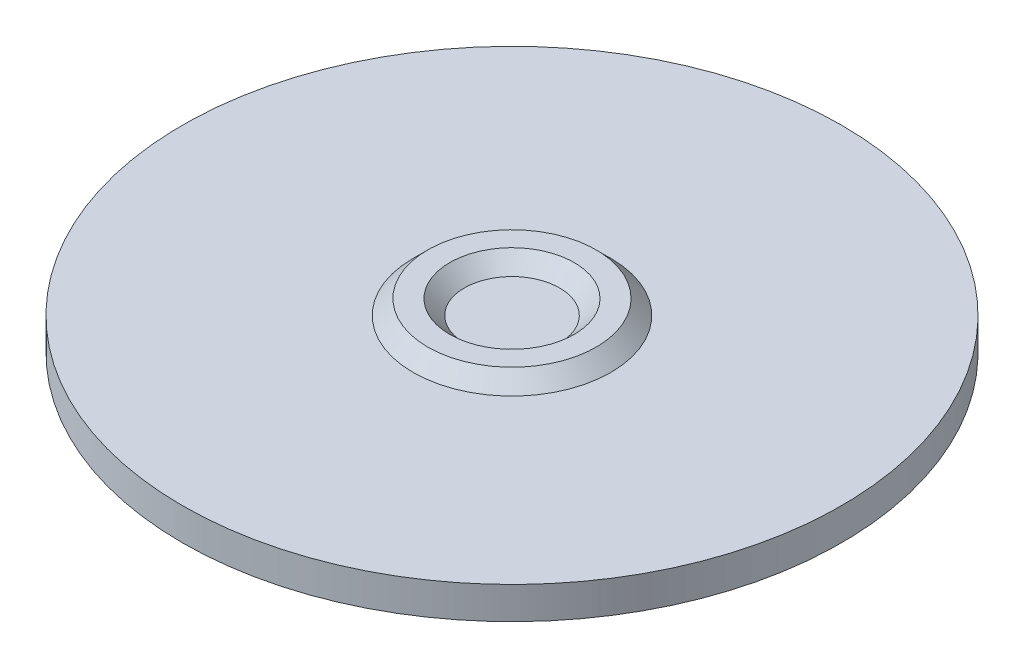
ISO-10303-21;
HEADER;
FILE_DESCRIPTION(('STEP AP214'),'2;1');
FILE_NAME('part.step','',(''),(''),'','','');
FILE_SCHEMA(('AUTOMOTIVE_DESIGN { 1 0 10303 214 1 1 1 1 }'));
ENDSEC;
DATA;
#1=APPLICATION_CONTEXT('core data for automotive mechanical design processes');
#2=APPLICATION_PROTOCOL_DEFINITION('international standard','automotive_design',2000,#1);
#3=PRODUCT_CONTEXT('',#1,'mechanical');
#4=PRODUCT('Part','Part','',(#3));
#5=PRODUCT_RELATED_PRODUCT_CATEGORY('part','',(#4));
#6=PRODUCT_DEFINITION_FORMATION('','',#4);
#7=PRODUCT_DEFINITION_CONTEXT('part definition',#1,'design');
#8=PRODUCT_DEFINITION('design','',#6,#7);
#9=PRODUCT_DEFINITION_SHAPE('','',#8);
#10=(LENGTH_UNIT() NAMED_UNIT(*) SI_UNIT(.MILLI.,.METRE.));
#11=(NAMED_UNIT(*) PLANE_ANGLE_UNIT() SI_UNIT($,.RADIAN.));
#12=(NAMED_UNIT(*) SI_UNIT($,.STERADIAN.) SOLID_ANGLE_UNIT());
#13=UNCERTAINTY_MEASURE_WITH_UNIT(LENGTH_MEASURE(1.E-05),#10,'distance_accuracy_value','');
#14=(GEOMETRIC_REPRESENTATION_CONTEXT(3) GLOBAL_UNCERTAINTY_ASSIGNED_CONTEXT((#13)) GLOBAL_UNIT_ASSIGNED_CONTEXT((#10,
#11,#12)) REPRESENTATION_CONTEXT('',''));
#15=CARTESIAN_POINT('',(0.,0.,0.));
#16=DIRECTION('',(0.,0.,1.));
#17=DIRECTION('',(1.,0.,0.));
#18=AXIS2_PLACEMENT_3D('',#15,#16,#17);
#19=CARTESIAN_POINT('',(0.,2.2,0.));
#20=DIRECTION('',(0.,-1.,0.));
#21=DIRECTION('',(0.,0.,1.));
#22=AXIS2_PLACEMENT_3D('',#19,#20,#21);
#23=CONICAL_SURFACE('',#22,6.75,0.78539816339745);
#24=CARTESIAN_POINT('',(0.,3.2,0.));
#25=DIRECTION('',(0.,1.,0.));
#26=DIRECTION('',(0.,0.,1.));
#27=AXIS2_PLACEMENT_3D('',#24,#25,#26);
#28=CIRCLE('',#27,5.75);
#29=CARTESIAN_POINT('',(0.,3.2,5.75));
#30=VERTEX_POINT('',#29);
#31=EDGE_CURVE('E11',#30,#30,#28,.T.);
#32=ORIENTED_EDGE('',*,*,#31,.F.);
#33=EDGE_LOOP('',(#32));
#34=FACE_BOUND('',#33,.T.);
#35=CARTESIAN_POINT('',(0.,2.2,0.));
#36=DIRECTION('',(0.,1.,0.));
#37=DIRECTION('',(0.,0.,1.));
#38=AXIS2_PLACEMENT_3D('',#35,#36,#37);
#39=CIRCLE('',#38,6.75);
#40=CARTESIAN_POINT('',(0.,2.2,6.75));
#41=VERTEX_POINT('',#40);
#42=EDGE_CURVE('E52',#41,#41,#39,.T.);
#43=ORIENTED_EDGE('',*,*,#42,.T.);
#44=EDGE_LOOP('',(#43));
#45=FACE_BOUND('',#44,.T.);
#46=ADVANCED_FACE('F46',(#34,#45),#23,.T.);
#47=CARTESIAN_POINT('',(0.,3.2,0.));
#48=DIRECTION('',(0.,1.,0.));
#49=DIRECTION('',(0.,0.,1.));
#50=AXIS2_PLACEMENT_3D('',#47,#48,#49);
#51=PLANE('',#50);
#52=CARTESIAN_POINT('',(0.,3.2,0.));
#53=DIRECTION('',(0.,1.,0.));
#54=DIRECTION('',(0.,0.,1.));
#55=AXIS2_PLACEMENT_3D('',#52,#53,#54);
#56=CIRCLE('',#55,4.25);
#57=CARTESIAN_POINT('',(0.,3.2,4.25));
#58=VERTEX_POINT('',#57);
#59=EDGE_CURVE('E60',#58,#58,#56,.T.);
#60=ORIENTED_EDGE('',*,*,#59,.F.);
#61=EDGE_LOOP('',(#60));
#62=FACE_BOUND('',#61,.T.);
#63=ORIENTED_EDGE('',*,*,#31,.T.);
#64=EDGE_LOOP('',(#63));
#65=FACE_BOUND('',#64,.T.);
#66=ADVANCED_FACE('F68',(#62,#65),#51,.T.);
#67=CARTESIAN_POINT('',(0.,2.2,0.));
#68=DIRECTION('',(0.,1.,0.));
#69=DIRECTION('',(0.,0.,1.));
#70=AXIS2_PLACEMENT_3D('',#67,#68,#69);
#71=PLANE('',#70);
#72=CARTESIAN_POINT('',(0.,2.2,0.));
#73=DIRECTION('',(0.,1.,0.));
#74=DIRECTION('',(0.,0.,1.));
#75=AXIS2_PLACEMENT_3D('',#72,#73,#74);
#76=CIRCLE('',#75,3.25);
#77=CARTESIAN_POINT('',(0.,2.2,3.25));
#78=VERTEX_POINT('',#77);
#79=EDGE_CURVE('E56',#78,#78,#76,.T.);
#80=ORIENTED_EDGE('',*,*,#79,.T.);
#81=EDGE_LOOP('',(#80));
#82=FACE_BOUND('',#81,.T.);
#83=ORIENTED_EDGE('',*,*,#42,.F.);
#84=EDGE_LOOP('',(#83));
#85=FACE_BOUND('',#84,.T.);
#86=ADVANCED_FACE('F70',(#82,#85),#71,.F.);
#87=CARTESIAN_POINT('',(0.,3.2,0.));
#88=DIRECTION('',(0.,1.,0.));
#89=DIRECTION('',(0.,0.,1.));
#90=AXIS2_PLACEMENT_3D('',#87,#88,#89);
#91=CONICAL_SURFACE('',#90,4.25,0.78539816339745);
#92=ORIENTED_EDGE('',*,*,#79,.F.);
#93=EDGE_LOOP('',(#92));
#94=FACE_BOUND('',#93,.T.);
#95=ORIENTED_EDGE('',*,*,#59,.T.);
#96=EDGE_LOOP('',(#95));
#97=FACE_BOUND('',#96,.T.);
#98=ADVANCED_FACE('F66',(#94,#97),#91,.F.);
#99=CLOSED_SHELL('',(#46,#66,#86,#98));
#100=MANIFOLD_SOLID_BREP('B2',#99);
#101=CARTESIAN_POINT('',(0.,2.2,0.));
#102=DIRECTION('',(0.,-1.,0.));
#103=DIRECTION('',(0.,0.,-1.));
#104=AXIS2_PLACEMENT_3D('',#101,#102,#103);
#105=CYLINDRICAL_SURFACE('',#104,22.5);
#106=CARTESIAN_POINT('',(0.,2.2,0.));
#107=DIRECTION('',(0.,1.,0.));
#108=DIRECTION('',(0.,0.,1.));
#109=AXIS2_PLACEMENT_3D('',#106,#107,#108);
#110=CIRCLE('',#109,22.5);
#111=CARTESIAN_POINT('',(0.,2.2,22.5));
#112=VERTEX_POINT('',#111);
#113=EDGE_CURVE('E45',#112,#112,#110,.T.);
#114=ORIENTED_EDGE('',*,*,#113,.F.);
#115=EDGE_LOOP('',(#114));
#116=FACE_BOUND('',#115,.T.);
#117=CARTESIAN_POINT('',(0.,0.,0.));
#118=DIRECTION('',(0.,1.,0.));
#119=DIRECTION('',(0.,0.,1.));
#120=AXIS2_PLACEMENT_3D('',#117,#118,#119);
#121=CIRCLE('',#120,22.5);
#122=CARTESIAN_POINT('',(0.,0.,22.5));
#123=VERTEX_POINT('',#122);
#124=EDGE_CURVE('E116',#123,#123,#121,.T.);
#125=ORIENTED_EDGE('',*,*,#124,.T.);
#126=EDGE_LOOP('',(#125));
#127=FACE_BOUND('',#126,.T.);
#128=ADVANCED_FACE('F113',(#116,#127),#105,.T.);
#129=CARTESIAN_POINT('',(0.,2.2,0.));
#130=DIRECTION('',(0.,1.,0.));
#131=DIRECTION('',(0.,0.,1.));
#132=AXIS2_PLACEMENT_3D('',#129,#130,#131);
#133=PLANE('',#132);
#134=ORIENTED_EDGE('',*,*,#113,.T.);
#135=EDGE_LOOP('',(#134));
#136=FACE_BOUND('',#135,.T.);
#137=ADVANCED_FACE('F128',(#136),#133,.T.);
#138=CARTESIAN_POINT('',(0.,0.,0.));
#139=DIRECTION('',(0.,1.,0.));
#140=DIRECTION('',(0.,0.,1.));
#141=AXIS2_PLACEMENT_3D('',#138,#139,#140);
#142=PLANE('',#141);
#143=ORIENTED_EDGE('',*,*,#124,.F.);
#144=EDGE_LOOP('',(#143));
#145=FACE_BOUND('',#144,.T.);
#146=ADVANCED_FACE('F126',(#145),#142,.F.);
#147=CLOSED_SHELL('',(#128,#137,#146));
#148=MANIFOLD_SOLID_BREP('B6',#147);
#149=ADVANCED_BREP_SHAPE_REPRESENTATION('',(#18,#100,#148),#14);
#150=SHAPE_DEFINITION_REPRESENTATION(#9,#149);
ENDSEC;
END-ISO-10303-21;
